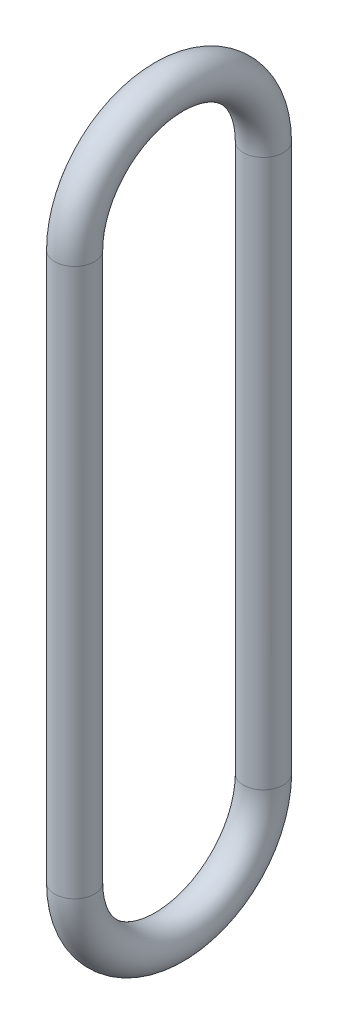
ISO-10303-21;
HEADER;
FILE_DESCRIPTION(('STEP AP214'),'2;1');
FILE_NAME('part.step','',(''),(''),'','','');
FILE_SCHEMA(('AUTOMOTIVE_DESIGN { 1 0 10303 214 1 1 1 1 }'));
ENDSEC;
DATA;
#1=APPLICATION_CONTEXT('core data for automotive mechanical design processes');
#2=APPLICATION_PROTOCOL_DEFINITION('international standard','automotive_design',2000,#1);
#3=PRODUCT_CONTEXT('',#1,'mechanical');
#4=PRODUCT('Part','Part','',(#3));
#5=PRODUCT_RELATED_PRODUCT_CATEGORY('part','',(#4));
#6=PRODUCT_DEFINITION_FORMATION('','',#4);
#7=PRODUCT_DEFINITION_CONTEXT('part definition',#1,'design');
#8=PRODUCT_DEFINITION('design','',#6,#7);
#9=PRODUCT_DEFINITION_SHAPE('','',#8);
#10=(LENGTH_UNIT() NAMED_UNIT(*) SI_UNIT(.MILLI.,.METRE.));
#11=(NAMED_UNIT(*) PLANE_ANGLE_UNIT() SI_UNIT($,.RADIAN.));
#12=(NAMED_UNIT(*) SI_UNIT($,.STERADIAN.) SOLID_ANGLE_UNIT());
#13=UNCERTAINTY_MEASURE_WITH_UNIT(LENGTH_MEASURE(1.E-05),#10,'distance_accuracy_value','');
#14=(GEOMETRIC_REPRESENTATION_CONTEXT(3) GLOBAL_UNCERTAINTY_ASSIGNED_CONTEXT((#13)) GLOBAL_UNIT_ASSIGNED_CONTEXT((#10,
#11,#12)) REPRESENTATION_CONTEXT('',''));
#15=CARTESIAN_POINT('',(0.,0.,0.));
#16=DIRECTION('',(0.,0.,1.));
#17=DIRECTION('',(1.,0.,0.));
#18=AXIS2_PLACEMENT_3D('',#15,#16,#17);
#19=CARTESIAN_POINT('',(0.,175.02378,0.));
#20=DIRECTION('',(0.,-1.,0.));
#21=DIRECTION('',(0.,0.,-1.));
#22=AXIS2_PLACEMENT_3D('',#19,#20,#21);
#23=CYLINDRICAL_SURFACE('',#22,6.35);
#24=CARTESIAN_POINT('',(0.,175.02378,0.));
#25=DIRECTION('',(0.,1.,0.));
#26=DIRECTION('',(0.,0.,1.));
#27=AXIS2_PLACEMENT_3D('',#24,#25,#26);
#28=CIRCLE('',#27,6.35);
#29=CARTESIAN_POINT('',(0.,175.023779999999,-6.35000000000004));
#30=VERTEX_POINT('',#29);
#31=EDGE_CURVE('E40',#30,#30,#28,.T.);
#32=ORIENTED_EDGE('',*,*,#31,.F.);
#33=EDGE_LOOP('',(#32));
#34=FACE_BOUND('',#33,.T.);
#35=CARTESIAN_POINT('',(0.,-3.33066907387547E-13,0.));
#36=DIRECTION('',(0.,1.,0.));
#37=DIRECTION('',(0.,0.,1.));
#38=AXIS2_PLACEMENT_3D('',#35,#36,#37);
#39=CIRCLE('',#38,6.35);
#40=CARTESIAN_POINT('',(0.,-3.33066907387547E-13,6.34999999999996));
#41=VERTEX_POINT('',#40);
#42=EDGE_CURVE('E10',#41,#41,#39,.T.);
#43=ORIENTED_EDGE('',*,*,#42,.T.);
#44=EDGE_LOOP('',(#43));
#45=FACE_BOUND('',#44,.T.);
#46=ADVANCED_FACE('F30',(#34,#45),#23,.T.);
#47=CARTESIAN_POINT('',(0.,175.02378,30.1625));
#48=DIRECTION('',(-1.,0.,0.));
#49=DIRECTION('',(0.,0.,1.));
#50=AXIS2_PLACEMENT_3D('',#47,#48,#49);
#51=TOROIDAL_SURFACE('',#50,30.1625,6.35);
#52=CARTESIAN_POINT('',(0.,175.02378,60.325));
#53=DIRECTION('',(0.,-1.,0.));
#54=DIRECTION('',(0.,0.,-1.));
#55=AXIS2_PLACEMENT_3D('',#52,#53,#54);
#56=CIRCLE('',#55,6.35);
#57=CARTESIAN_POINT('',(0.,175.02378,66.675));
#58=VERTEX_POINT('',#57);
#59=EDGE_CURVE('E45',#58,#58,#56,.T.);
#60=CARTESIAN_POINT('',(0.,175.02378,30.1625));
#61=DIRECTION('',(-1.,0.,0.));
#62=DIRECTION('',(0.,0.,1.));
#63=AXIS2_PLACEMENT_3D('',#60,#61,#62);
#64=CIRCLE('',#63,36.5125);
#65=EDGE_CURVE('',#58,#30,#64,.T.);
#66=ORIENTED_EDGE('',*,*,#59,.F.);
#67=ORIENTED_EDGE('',*,*,#31,.T.);
#68=ORIENTED_EDGE('',*,*,#65,.T.);
#69=ORIENTED_EDGE('',*,*,#65,.F.);
#70=EDGE_LOOP('',(#66,#68,#67,#69));
#71=FACE_BOUND('',#70,.T.);
#72=ADVANCED_FACE('F69',(#71),#51,.T.);
#73=CARTESIAN_POINT('',(0.,4.24941064439353E-13,60.3250000000001));
#74=DIRECTION('',(0.,1.,0.));
#75=DIRECTION('',(0.,0.,1.));
#76=AXIS2_PLACEMENT_3D('',#73,#74,#75);
#77=CYLINDRICAL_SURFACE('',#76,6.35);
#78=CARTESIAN_POINT('',(0.,4.24941064439353E-13,60.3250000000001));
#79=DIRECTION('',(0.,-1.,0.));
#80=DIRECTION('',(0.,0.,-1.));
#81=AXIS2_PLACEMENT_3D('',#78,#79,#80);
#82=CIRCLE('',#81,6.35);
#83=CARTESIAN_POINT('',(0.,3.35479787715279E-13,53.9750000000001));
#84=VERTEX_POINT('',#83);
#85=EDGE_CURVE('E50',#84,#84,#82,.T.);
#86=ORIENTED_EDGE('',*,*,#85,.F.);
#87=EDGE_LOOP('',(#86));
#88=FACE_BOUND('',#87,.T.);
#89=ORIENTED_EDGE('',*,*,#59,.T.);
#90=EDGE_LOOP('',(#89));
#91=FACE_BOUND('',#90,.T.);
#92=ADVANCED_FACE('F64',(#88,#91),#77,.T.);
#93=CARTESIAN_POINT('',(0.,0.,30.1625));
#94=DIRECTION('',(1.,0.,0.));
#95=DIRECTION('',(0.,0.,-1.));
#96=AXIS2_PLACEMENT_3D('',#93,#94,#95);
#97=TOROIDAL_SURFACE('',#96,30.1625,6.35);
#98=ORIENTED_EDGE('',*,*,#85,.T.);
#99=EDGE_LOOP('',(#98));
#100=FACE_BOUND('',#99,.T.);
#101=ORIENTED_EDGE('',*,*,#42,.F.);
#102=EDGE_LOOP('',(#101));
#103=FACE_BOUND('',#102,.T.);
#104=ADVANCED_FACE('F62',(#100,#103),#97,.T.);
#105=CLOSED_SHELL('',(#46,#72,#92,#104));
#106=MANIFOLD_SOLID_BREP('B2',#105);
#107=ADVANCED_BREP_SHAPE_REPRESENTATION('',(#18,#106),#14);
#108=SHAPE_DEFINITION_REPRESENTATION(#9,#107);
ENDSEC;
END-ISO-10303-21;
